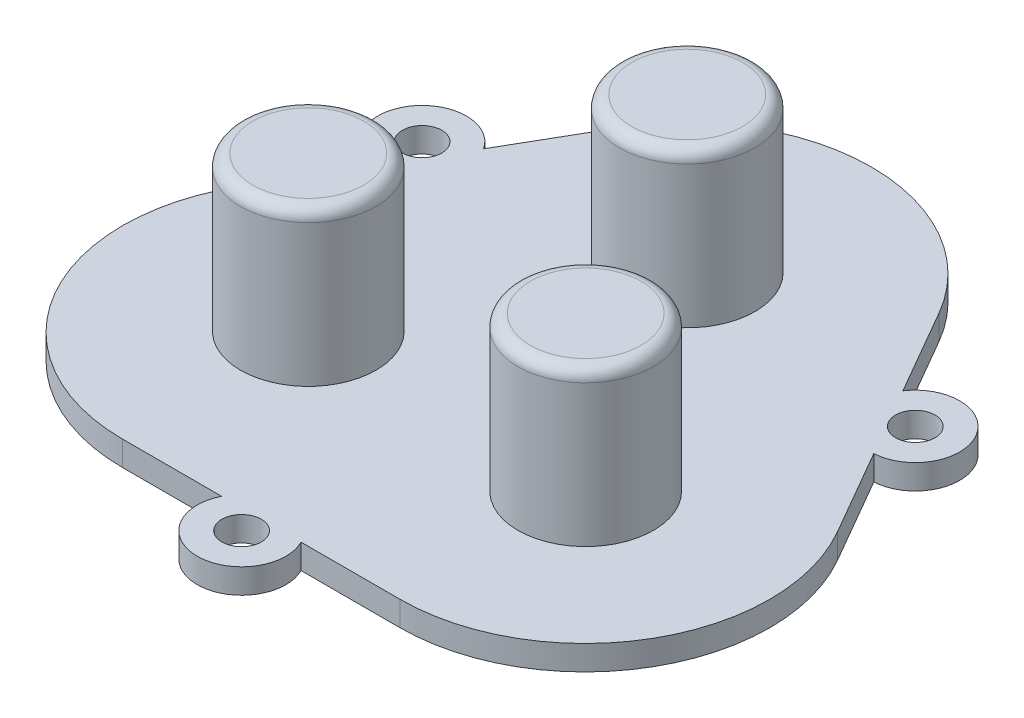
ISO-10303-21;
HEADER;
FILE_DESCRIPTION(('STEP AP214'),'2;1');
FILE_NAME('part.step','',(''),(''),'','','');
FILE_SCHEMA(('AUTOMOTIVE_DESIGN { 1 0 10303 214 1 1 1 1 }'));
ENDSEC;
DATA;
#1=APPLICATION_CONTEXT('core data for automotive mechanical design processes');
#2=APPLICATION_PROTOCOL_DEFINITION('international standard','automotive_design',2000,#1);
#3=PRODUCT_CONTEXT('',#1,'mechanical');
#4=PRODUCT('Part','Part','',(#3));
#5=PRODUCT_RELATED_PRODUCT_CATEGORY('part','',(#4));
#6=PRODUCT_DEFINITION_FORMATION('','',#4);
#7=PRODUCT_DEFINITION_CONTEXT('part definition',#1,'design');
#8=PRODUCT_DEFINITION('design','',#6,#7);
#9=PRODUCT_DEFINITION_SHAPE('','',#8);
#10=(LENGTH_UNIT() NAMED_UNIT(*) SI_UNIT(.MILLI.,.METRE.));
#11=(NAMED_UNIT(*) PLANE_ANGLE_UNIT() SI_UNIT($,.RADIAN.));
#12=(NAMED_UNIT(*) SI_UNIT($,.STERADIAN.) SOLID_ANGLE_UNIT());
#13=UNCERTAINTY_MEASURE_WITH_UNIT(LENGTH_MEASURE(1.E-05),#10,'distance_accuracy_value','');
#14=(GEOMETRIC_REPRESENTATION_CONTEXT(3) GLOBAL_UNCERTAINTY_ASSIGNED_CONTEXT((#13)) GLOBAL_UNIT_ASSIGNED_CONTEXT((#10,
#11,#12)) REPRESENTATION_CONTEXT('',''));
#15=CARTESIAN_POINT('',(0.,0.,0.));
#16=DIRECTION('',(0.,0.,1.));
#17=DIRECTION('',(1.,0.,0.));
#18=AXIS2_PLACEMENT_3D('',#15,#16,#17);
#19=CARTESIAN_POINT('',(-11.2500000511737,2.,7.14278559354404));
#20=DIRECTION('',(0.,1.,0.));
#21=DIRECTION('',(0.,0.,1.));
#22=AXIS2_PLACEMENT_3D('',#19,#20,#21);
#23=PLANE('',#22);
#24=CARTESIAN_POINT('',(-11.3100251260065,2.,7.02273544387849));
#25=DIRECTION('',(0.,1.,0.));
#26=DIRECTION('',(0.,0.,1.));
#27=AXIS2_PLACEMENT_3D('',#24,#25,#26);
#28=CIRCLE('',#27,5.5);
#29=CARTESIAN_POINT('',(-11.3100251260065,2.,12.5227354438785));
#30=VERTEX_POINT('',#29);
#31=EDGE_CURVE('E422',#30,#30,#28,.F.);
#32=ORIENTED_EDGE('',*,*,#31,.T.);
#33=EDGE_LOOP('',(#32));
#34=FACE_BOUND('',#33,.T.);
#35=CARTESIAN_POINT('',(11.1899748739934,2.,7.02273544387849));
#36=DIRECTION('',(0.,1.,0.));
#37=DIRECTION('',(0.,0.,1.));
#38=AXIS2_PLACEMENT_3D('',#35,#36,#37);
#39=CIRCLE('',#38,5.5);
#40=CARTESIAN_POINT('',(11.1899748739934,2.,12.5227354438785));
#41=VERTEX_POINT('',#40);
#42=EDGE_CURVE('E413',#41,#41,#39,.F.);
#43=ORIENTED_EDGE('',*,*,#42,.T.);
#44=EDGE_LOOP('',(#43));
#45=FACE_BOUND('',#44,.T.);
#46=CARTESIAN_POINT('',(-0.0600251260065108,2.,-12.4628361412714));
#47=DIRECTION('',(0.,1.,0.));
#48=DIRECTION('',(0.,0.,1.));
#49=AXIS2_PLACEMENT_3D('',#46,#47,#48);
#50=CIRCLE('',#49,5.5);
#51=CARTESIAN_POINT('',(-0.0600251260065108,2.,-6.96283614127141));
#52=VERTEX_POINT('',#51);
#53=EDGE_CURVE('E409',#52,#52,#50,.F.);
#54=ORIENTED_EDGE('',*,*,#53,.T.);
#55=EDGE_LOOP('',(#54));
#56=FACE_BOUND('',#55,.T.);
#57=CARTESIAN_POINT('',(-20.0010217539954,2.,-10.9000001990309));
#58=DIRECTION('',(0.,1.,0.));
#59=DIRECTION('',(0.,0.,1.));
#60=AXIS2_PLACEMENT_3D('',#57,#58,#59);
#61=CIRCLE('',#60,1.6);
#62=CARTESIAN_POINT('',(-20.0010217539954,2.,-9.30000019903093));
#63=VERTEX_POINT('',#62);
#64=EDGE_CURVE('E286',#63,#63,#61,.T.);
#65=ORIENTED_EDGE('',*,*,#64,.F.);
#66=EDGE_LOOP('',(#65));
#67=FACE_BOUND('',#66,.T.);
#68=CARTESIAN_POINT('',(-11.2500000511737,2.,7.14278559354404));
#69=DIRECTION('',(0.,1.,0.));
#70=DIRECTION('',(0.,0.,1.));
#71=AXIS2_PLACEMENT_3D('',#68,#69,#70);
#72=CIRCLE('',#71,15.);
#73=CARTESIAN_POINT('',(-24.2403811079403,2.,-0.357214406455925));
#74=VERTEX_POINT('',#73);
#75=CARTESIAN_POINT('',(-11.2500000511737,2.,22.142785593544));
#76=VERTEX_POINT('',#75);
#77=EDGE_CURVE('E186',#74,#76,#72,.T.);
#78=ORIENTED_EDGE('',*,*,#77,.T.);
#79=DIRECTION('',(1.,0.,0.));
#80=VECTOR('',#79,1.);
#81=CARTESIAN_POINT('',(-11.2500000511737,2.,22.142785593544));
#82=LINE('',#81,#80);
#83=CARTESIAN_POINT('',(-3.2249031504929,2.,22.1427855935441));
#84=VERTEX_POINT('',#83);
#85=EDGE_CURVE('E114',#76,#84,#82,.T.);
#86=ORIENTED_EDGE('',*,*,#85,.T.);
#87=CARTESIAN_POINT('',(-5.11722688081806E-08,2.,23.7427855935431));
#88=DIRECTION('',(0.,1.,0.));
#89=DIRECTION('',(0.,0.,1.));
#90=AXIS2_PLACEMENT_3D('',#87,#88,#89);
#91=CIRCLE('',#90,3.60000000000066);
#92=CARTESIAN_POINT('',(3.22490304814838,2.,22.1427855935442));
#93=VERTEX_POINT('',#92);
#94=EDGE_CURVE('E296',#84,#93,#91,.T.);
#95=ORIENTED_EDGE('',*,*,#94,.T.);
#96=DIRECTION('',(1.,0.,0.));
#97=VECTOR('',#96,1.);
#98=CARTESIAN_POINT('',(3.22490304814839,2.,22.1427855935442));
#99=LINE('',#98,#97);
#100=CARTESIAN_POINT('',(11.2499999488263,2.,22.1427855935442));
#101=VERTEX_POINT('',#100);
#102=EDGE_CURVE('E298',#93,#101,#99,.T.);
#103=ORIENTED_EDGE('',*,*,#102,.T.);
#104=CARTESIAN_POINT('',(11.2499999488264,2.,7.14278559354415));
#105=DIRECTION('',(0.,1.,0.));
#106=DIRECTION('',(0.,0.,1.));
#107=AXIS2_PLACEMENT_3D('',#104,#105,#106);
#108=CIRCLE('',#107,15.0000000000001);
#109=CARTESIAN_POINT('',(24.240381005593,2.,-0.357214406456034));
#110=VERTEX_POINT('',#109);
#111=EDGE_CURVE('E300',#101,#110,#108,.T.);
#112=ORIENTED_EDGE('',*,*,#111,.T.);
#113=DIRECTION('',(-0.500000000000005,0.,-0.866025403784436));
#114=VECTOR('',#113,1.);
#115=CARTESIAN_POINT('',(24.240381005593,2.,-0.357214406456022));
#116=LINE('',#115,#114);
#117=CARTESIAN_POINT('',(20.2278325552526,2.,-7.30715219027712));
#118=VERTEX_POINT('',#117);
#119=EDGE_CURVE('E302',#110,#118,#116,.T.);
#120=ORIENTED_EDGE('',*,*,#119,.T.);
#121=CARTESIAN_POINT('',(20.0010216516479,2.,-10.9000001990326));
#122=DIRECTION('',(0.,1.,0.));
#123=DIRECTION('',(0.,0.,1.));
#124=AXIS2_PLACEMENT_3D('',#121,#122,#123);
#125=CIRCLE('',#124,3.60000000000172);
#126=CARTESIAN_POINT('',(17.0029294559317,2.,-12.8928482077873));
#127=VERTEX_POINT('',#126);
#128=EDGE_CURVE('E304',#118,#127,#125,.T.);
#129=ORIENTED_EDGE('',*,*,#128,.T.);
#130=DIRECTION('',(-0.500000000000005,0.,-0.866025403784436));
#131=VECTOR('',#130,1.);
#132=CARTESIAN_POINT('',(17.0029294559317,2.,-12.8928482077873));
#133=LINE('',#132,#131);
#134=CARTESIAN_POINT('',(12.9903810055928,2.,-19.8427859916058));
#135=VERTEX_POINT('',#134);
#136=EDGE_CURVE('E306',#127,#135,#133,.T.);
#137=ORIENTED_EDGE('',*,*,#136,.T.);
#138=CARTESIAN_POINT('',(-5.11737398924087E-08,2.,-12.3427859916057));
#139=DIRECTION('',(0.,1.,0.));
#140=DIRECTION('',(0.,0.,1.));
#141=AXIS2_PLACEMENT_3D('',#138,#139,#140);
#142=CIRCLE('',#141,15.0000000000001);
#143=CARTESIAN_POINT('',(-12.9903811079403,2.,-19.8427859916058));
#144=VERTEX_POINT('',#143);
#145=EDGE_CURVE('E145',#135,#144,#142,.T.);
#146=ORIENTED_EDGE('',*,*,#145,.T.);
#147=DIRECTION('',(-0.499999999999998,0.,0.86602540378444));
#148=VECTOR('',#147,1.);
#149=CARTESIAN_POINT('',(-12.9903811079403,2.,-19.8427859916058));
#150=LINE('',#149,#148);
#151=CARTESIAN_POINT('',(-17.0029295582806,2.,-12.8928482077847));
#152=VERTEX_POINT('',#151);
#153=EDGE_CURVE('E139',#144,#152,#150,.T.);
#154=ORIENTED_EDGE('',*,*,#153,.T.);
#155=CARTESIAN_POINT('',(-20.0010217539954,2.,-10.9000001990309));
#156=DIRECTION('',(0.,1.,0.));
#157=DIRECTION('',(0.,0.,1.));
#158=AXIS2_PLACEMENT_3D('',#155,#156,#157);
#159=CIRCLE('',#158,3.6);
#160=CARTESIAN_POINT('',(-20.2278326576,2.,-7.30715219027715));
#161=VERTEX_POINT('',#160);
#162=EDGE_CURVE('E143',#152,#161,#159,.T.);
#163=ORIENTED_EDGE('',*,*,#162,.T.);
#164=DIRECTION('',(-0.499999999999998,0.,0.86602540378444));
#165=VECTOR('',#164,1.);
#166=CARTESIAN_POINT('',(-20.2278326576,2.,-7.30715219027714));
#167=LINE('',#166,#165);
#168=EDGE_CURVE('E58',#161,#74,#167,.T.);
#169=ORIENTED_EDGE('',*,*,#168,.T.);
#170=EDGE_LOOP('',(#78,#86,#95,#103,#112,#120,#129,#137,#146,#154,#163,#169));
#171=FACE_BOUND('',#170,.T.);
#172=CARTESIAN_POINT('',(-5.11722688081806E-08,2.,23.7427855935431));
#173=DIRECTION('',(0.,1.,0.));
#174=DIRECTION('',(0.,0.,1.));
#175=AXIS2_PLACEMENT_3D('',#172,#173,#174);
#176=CIRCLE('',#175,1.60000000000066);
#177=CARTESIAN_POINT('',(-5.11722688081806E-08,2.,25.3427855935438));
#178=VERTEX_POINT('',#177);
#179=EDGE_CURVE('E167',#178,#178,#176,.T.);
#180=ORIENTED_EDGE('',*,*,#179,.F.);
#181=EDGE_LOOP('',(#180));
#182=FACE_BOUND('',#181,.T.);
#183=CARTESIAN_POINT('',(20.0010216516479,2.,-10.9000001990326));
#184=DIRECTION('',(0.,1.,0.));
#185=DIRECTION('',(0.,0.,1.));
#186=AXIS2_PLACEMENT_3D('',#183,#184,#185);
#187=CIRCLE('',#186,1.60000000000172);
#188=CARTESIAN_POINT('',(20.0010216516479,2.,-9.30000019903091));
#189=VERTEX_POINT('',#188);
#190=EDGE_CURVE('E404',#189,#189,#187,.T.);
#191=ORIENTED_EDGE('',*,*,#190,.F.);
#192=EDGE_LOOP('',(#191));
#193=FACE_BOUND('',#192,.T.);
#194=ADVANCED_FACE('F41',(#34,#45,#56,#67,#171,#182,#193),#23,.T.);
#195=CARTESIAN_POINT('',(-11.2500000511737,0.,7.14278559354404));
#196=DIRECTION('',(0.,1.,0.));
#197=DIRECTION('',(0.,0.,1.));
#198=AXIS2_PLACEMENT_3D('',#195,#196,#197);
#199=PLANE('',#198);
#200=CARTESIAN_POINT('',(-11.2500000511737,0.,7.14278559354404));
#201=DIRECTION('',(0.,1.,0.));
#202=DIRECTION('',(0.,0.,1.));
#203=AXIS2_PLACEMENT_3D('',#200,#201,#202);
#204=CIRCLE('',#203,15.);
#205=CARTESIAN_POINT('',(-24.2403811079403,0.,-0.357214406455925));
#206=VERTEX_POINT('',#205);
#207=CARTESIAN_POINT('',(-11.2500000511737,0.,22.142785593544));
#208=VERTEX_POINT('',#207);
#209=EDGE_CURVE('E163',#206,#208,#204,.T.);
#210=ORIENTED_EDGE('',*,*,#209,.F.);
#211=DIRECTION('',(-0.499999999999998,0.,0.86602540378444));
#212=VECTOR('',#211,1.);
#213=CARTESIAN_POINT('',(-20.2278326576,0.,-7.30715219027714));
#214=LINE('',#213,#212);
#215=CARTESIAN_POINT('',(-20.2278326576,0.,-7.30715219027715));
#216=VERTEX_POINT('',#215);
#217=EDGE_CURVE('E105',#216,#206,#214,.T.);
#218=ORIENTED_EDGE('',*,*,#217,.F.);
#219=CARTESIAN_POINT('',(-20.0010217539954,0.,-10.9000001990309));
#220=DIRECTION('',(0.,1.,0.));
#221=DIRECTION('',(0.,0.,1.));
#222=AXIS2_PLACEMENT_3D('',#219,#220,#221);
#223=CIRCLE('',#222,3.6);
#224=CARTESIAN_POINT('',(-17.0029295582806,0.,-12.8928482077847));
#225=VERTEX_POINT('',#224);
#226=EDGE_CURVE('E99',#225,#216,#223,.T.);
#227=ORIENTED_EDGE('',*,*,#226,.F.);
#228=DIRECTION('',(-0.499999999999998,0.,0.86602540378444));
#229=VECTOR('',#228,1.);
#230=CARTESIAN_POINT('',(-12.9903811079403,0.,-19.8427859916058));
#231=LINE('',#230,#229);
#232=CARTESIAN_POINT('',(-12.9903811079403,0.,-19.8427859916058));
#233=VERTEX_POINT('',#232);
#234=EDGE_CURVE('E153',#233,#225,#231,.T.);
#235=ORIENTED_EDGE('',*,*,#234,.F.);
#236=CARTESIAN_POINT('',(-5.11737398924087E-08,0.,-12.3427859916057));
#237=DIRECTION('',(0.,1.,0.));
#238=DIRECTION('',(0.,0.,1.));
#239=AXIS2_PLACEMENT_3D('',#236,#237,#238);
#240=CIRCLE('',#239,15.0000000000001);
#241=CARTESIAN_POINT('',(12.9903810055928,0.,-19.8427859916058));
#242=VERTEX_POINT('',#241);
#243=EDGE_CURVE('E181',#242,#233,#240,.T.);
#244=ORIENTED_EDGE('',*,*,#243,.F.);
#245=DIRECTION('',(-0.500000000000005,0.,-0.866025403784436));
#246=VECTOR('',#245,1.);
#247=CARTESIAN_POINT('',(17.0029294559317,0.,-12.8928482077873));
#248=LINE('',#247,#246);
#249=CARTESIAN_POINT('',(17.0029294559317,0.,-12.8928482077873));
#250=VERTEX_POINT('',#249);
#251=EDGE_CURVE('E179',#250,#242,#248,.T.);
#252=ORIENTED_EDGE('',*,*,#251,.F.);
#253=CARTESIAN_POINT('',(20.0010216516479,0.,-10.9000001990326));
#254=DIRECTION('',(0.,1.,0.));
#255=DIRECTION('',(0.,0.,1.));
#256=AXIS2_PLACEMENT_3D('',#253,#254,#255);
#257=CIRCLE('',#256,3.60000000000172);
#258=CARTESIAN_POINT('',(20.2278325552526,0.,-7.30715219027712));
#259=VERTEX_POINT('',#258);
#260=EDGE_CURVE('E177',#259,#250,#257,.T.);
#261=ORIENTED_EDGE('',*,*,#260,.F.);
#262=DIRECTION('',(-0.500000000000005,0.,-0.866025403784436));
#263=VECTOR('',#262,1.);
#264=CARTESIAN_POINT('',(24.240381005593,0.,-0.357214406456022));
#265=LINE('',#264,#263);
#266=CARTESIAN_POINT('',(24.240381005593,0.,-0.357214406456034));
#267=VERTEX_POINT('',#266);
#268=EDGE_CURVE('E175',#267,#259,#265,.T.);
#269=ORIENTED_EDGE('',*,*,#268,.F.);
#270=CARTESIAN_POINT('',(11.2499999488264,0.,7.14278559354415));
#271=DIRECTION('',(0.,1.,0.));
#272=DIRECTION('',(0.,0.,1.));
#273=AXIS2_PLACEMENT_3D('',#270,#271,#272);
#274=CIRCLE('',#273,15.0000000000001);
#275=CARTESIAN_POINT('',(11.2499999488263,0.,22.1427855935442));
#276=VERTEX_POINT('',#275);
#277=EDGE_CURVE('E173',#276,#267,#274,.T.);
#278=ORIENTED_EDGE('',*,*,#277,.F.);
#279=DIRECTION('',(1.,0.,0.));
#280=VECTOR('',#279,1.);
#281=CARTESIAN_POINT('',(3.22490304814839,0.,22.1427855935442));
#282=LINE('',#281,#280);
#283=CARTESIAN_POINT('',(3.22490304814838,0.,22.1427855935442));
#284=VERTEX_POINT('',#283);
#285=EDGE_CURVE('E171',#284,#276,#282,.T.);
#286=ORIENTED_EDGE('',*,*,#285,.F.);
#287=CARTESIAN_POINT('',(-5.11722688081806E-08,0.,23.7427855935431));
#288=DIRECTION('',(0.,1.,0.));
#289=DIRECTION('',(0.,0.,1.));
#290=AXIS2_PLACEMENT_3D('',#287,#288,#289);
#291=CIRCLE('',#290,3.60000000000066);
#292=CARTESIAN_POINT('',(-3.2249031504929,0.,22.1427855935441));
#293=VERTEX_POINT('',#292);
#294=EDGE_CURVE('E169',#293,#284,#291,.T.);
#295=ORIENTED_EDGE('',*,*,#294,.F.);
#296=DIRECTION('',(1.,0.,0.));
#297=VECTOR('',#296,1.);
#298=CARTESIAN_POINT('',(-11.2500000511737,0.,22.142785593544));
#299=LINE('',#298,#297);
#300=EDGE_CURVE('E166',#208,#293,#299,.T.);
#301=ORIENTED_EDGE('',*,*,#300,.F.);
#302=EDGE_LOOP('',(#210,#218,#227,#235,#244,#252,#261,#269,#278,#286,#295,#301));
#303=FACE_BOUND('',#302,.T.);
#304=CARTESIAN_POINT('',(-5.11722688081806E-08,0.,23.7427855935431));
#305=DIRECTION('',(0.,1.,0.));
#306=DIRECTION('',(0.,0.,1.));
#307=AXIS2_PLACEMENT_3D('',#304,#305,#306);
#308=CIRCLE('',#307,1.60000000000066);
#309=CARTESIAN_POINT('',(-5.11722688081806E-08,0.,25.3427855935438));
#310=VERTEX_POINT('',#309);
#311=EDGE_CURVE('E284',#310,#310,#308,.T.);
#312=ORIENTED_EDGE('',*,*,#311,.T.);
#313=EDGE_LOOP('',(#312));
#314=FACE_BOUND('',#313,.T.);
#315=CARTESIAN_POINT('',(-20.0010217539954,0.,-10.9000001990309));
#316=DIRECTION('',(0.,1.,0.));
#317=DIRECTION('',(0.,0.,1.));
#318=AXIS2_PLACEMENT_3D('',#315,#316,#317);
#319=CIRCLE('',#318,1.6);
#320=CARTESIAN_POINT('',(-20.0010217539954,0.,-9.30000019903093));
#321=VERTEX_POINT('',#320);
#322=EDGE_CURVE('E290',#321,#321,#319,.T.);
#323=ORIENTED_EDGE('',*,*,#322,.T.);
#324=EDGE_LOOP('',(#323));
#325=FACE_BOUND('',#324,.T.);
#326=CARTESIAN_POINT('',(20.0010216516479,0.,-10.9000001990326));
#327=DIRECTION('',(0.,1.,0.));
#328=DIRECTION('',(0.,0.,1.));
#329=AXIS2_PLACEMENT_3D('',#326,#327,#328);
#330=CIRCLE('',#329,1.60000000000172);
#331=CARTESIAN_POINT('',(20.0010216516479,0.,-9.30000019903091));
#332=VERTEX_POINT('',#331);
#333=EDGE_CURVE('E407',#332,#332,#330,.T.);
#334=ORIENTED_EDGE('',*,*,#333,.T.);
#335=EDGE_LOOP('',(#334));
#336=FACE_BOUND('',#335,.T.);
#337=ADVANCED_FACE('F252',(#303,#314,#325,#336),#199,.F.);
#338=CARTESIAN_POINT('',(-11.2500000511737,2.,7.14278559354404));
#339=DIRECTION('',(0.,-1.,0.));
#340=DIRECTION('',(0.,0.,-1.));
#341=AXIS2_PLACEMENT_3D('',#338,#339,#340);
#342=CYLINDRICAL_SURFACE('',#341,15.);
#343=ORIENTED_EDGE('',*,*,#209,.T.);
#344=DIRECTION('',(0.,-1.,0.));
#345=VECTOR('',#344,1.);
#346=CARTESIAN_POINT('',(-11.2500000511737,2.,22.142785593544));
#347=LINE('',#346,#345);
#348=EDGE_CURVE('E211',#76,#208,#347,.T.);
#349=ORIENTED_EDGE('',*,*,#348,.F.);
#350=ORIENTED_EDGE('',*,*,#77,.F.);
#351=DIRECTION('',(0.,-1.,0.));
#352=VECTOR('',#351,1.);
#353=CARTESIAN_POINT('',(-24.2403811079403,2.,-0.357214406455925));
#354=LINE('',#353,#352);
#355=EDGE_CURVE('E159',#74,#206,#354,.T.);
#356=ORIENTED_EDGE('',*,*,#355,.T.);
#357=EDGE_LOOP('',(#343,#349,#350,#356));
#358=FACE_BOUND('',#357,.T.);
#359=ADVANCED_FACE('F259',(#358),#342,.T.);
#360=CARTESIAN_POINT('',(-11.2500000511737,2.,22.142785593544));
#361=DIRECTION('',(0.,0.,-1.));
#362=DIRECTION('',(-1.,0.,0.));
#363=AXIS2_PLACEMENT_3D('',#360,#361,#362);
#364=PLANE('',#363);
#365=ORIENTED_EDGE('',*,*,#300,.T.);
#366=DIRECTION('',(0.,-1.,0.));
#367=VECTOR('',#366,1.);
#368=CARTESIAN_POINT('',(-3.2249031504929,2.,22.1427855935441));
#369=LINE('',#368,#367);
#370=EDGE_CURVE('E208',#84,#293,#369,.T.);
#371=ORIENTED_EDGE('',*,*,#370,.F.);
#372=ORIENTED_EDGE('',*,*,#85,.F.);
#373=ORIENTED_EDGE('',*,*,#348,.T.);
#374=EDGE_LOOP('',(#365,#371,#372,#373));
#375=FACE_BOUND('',#374,.T.);
#376=ADVANCED_FACE('F321',(#375),#364,.F.);
#377=CARTESIAN_POINT('',(-5.11722688081806E-08,2.,23.7427855935431));
#378=DIRECTION('',(0.,-1.,0.));
#379=DIRECTION('',(0.,0.,-1.));
#380=AXIS2_PLACEMENT_3D('',#377,#378,#379);
#381=CYLINDRICAL_SURFACE('',#380,3.60000000000066);
#382=ORIENTED_EDGE('',*,*,#294,.T.);
#383=DIRECTION('',(0.,-1.,0.));
#384=VECTOR('',#383,1.);
#385=CARTESIAN_POINT('',(3.22490304814838,2.,22.1427855935442));
#386=LINE('',#385,#384);
#387=EDGE_CURVE('E205',#93,#284,#386,.T.);
#388=ORIENTED_EDGE('',*,*,#387,.F.);
#389=ORIENTED_EDGE('',*,*,#94,.F.);
#390=ORIENTED_EDGE('',*,*,#370,.T.);
#391=EDGE_LOOP('',(#382,#388,#389,#390));
#392=FACE_BOUND('',#391,.T.);
#393=ADVANCED_FACE('F323',(#392),#381,.T.);
#394=CARTESIAN_POINT('',(3.22490304814839,2.,22.1427855935442));
#395=DIRECTION('',(0.,0.,-1.));
#396=DIRECTION('',(-1.,0.,0.));
#397=AXIS2_PLACEMENT_3D('',#394,#395,#396);
#398=PLANE('',#397);
#399=ORIENTED_EDGE('',*,*,#285,.T.);
#400=DIRECTION('',(0.,-1.,0.));
#401=VECTOR('',#400,1.);
#402=CARTESIAN_POINT('',(11.2499999488263,2.,22.1427855935442));
#403=LINE('',#402,#401);
#404=EDGE_CURVE('E202',#101,#276,#403,.T.);
#405=ORIENTED_EDGE('',*,*,#404,.F.);
#406=ORIENTED_EDGE('',*,*,#102,.F.);
#407=ORIENTED_EDGE('',*,*,#387,.T.);
#408=EDGE_LOOP('',(#399,#405,#406,#407));
#409=FACE_BOUND('',#408,.T.);
#410=ADVANCED_FACE('F328',(#409),#398,.F.);
#411=CARTESIAN_POINT('',(11.2499999488264,2.,7.14278559354415));
#412=DIRECTION('',(0.,-1.,0.));
#413=DIRECTION('',(0.,0.,-1.));
#414=AXIS2_PLACEMENT_3D('',#411,#412,#413);
#415=CYLINDRICAL_SURFACE('',#414,15.0000000000001);
#416=ORIENTED_EDGE('',*,*,#277,.T.);
#417=DIRECTION('',(0.,-1.,0.));
#418=VECTOR('',#417,1.);
#419=CARTESIAN_POINT('',(24.240381005593,2.,-0.357214406456034));
#420=LINE('',#419,#418);
#421=EDGE_CURVE('E199',#110,#267,#420,.T.);
#422=ORIENTED_EDGE('',*,*,#421,.F.);
#423=ORIENTED_EDGE('',*,*,#111,.F.);
#424=ORIENTED_EDGE('',*,*,#404,.T.);
#425=EDGE_LOOP('',(#416,#422,#423,#424));
#426=FACE_BOUND('',#425,.T.);
#427=ADVANCED_FACE('F334',(#426),#415,.T.);
#428=CARTESIAN_POINT('',(24.240381005593,2.,-0.357214406456022));
#429=DIRECTION('',(-0.866025403784436,0.,0.500000000000005));
#430=DIRECTION('',(0.500000000000005,0.,0.866025403784436));
#431=AXIS2_PLACEMENT_3D('',#428,#429,#430);
#432=PLANE('',#431);
#433=ORIENTED_EDGE('',*,*,#268,.T.);
#434=DIRECTION('',(0.,-1.,0.));
#435=VECTOR('',#434,1.);
#436=CARTESIAN_POINT('',(20.2278325552526,2.,-7.30715219027712));
#437=LINE('',#436,#435);
#438=EDGE_CURVE('E196',#118,#259,#437,.T.);
#439=ORIENTED_EDGE('',*,*,#438,.F.);
#440=ORIENTED_EDGE('',*,*,#119,.F.);
#441=ORIENTED_EDGE('',*,*,#421,.T.);
#442=EDGE_LOOP('',(#433,#439,#440,#441));
#443=FACE_BOUND('',#442,.T.);
#444=ADVANCED_FACE('F338',(#443),#432,.F.);
#445=CARTESIAN_POINT('',(20.0010216516479,2.,-10.9000001990326));
#446=DIRECTION('',(0.,-1.,0.));
#447=DIRECTION('',(0.,0.,-1.));
#448=AXIS2_PLACEMENT_3D('',#445,#446,#447);
#449=CYLINDRICAL_SURFACE('',#448,3.60000000000172);
#450=ORIENTED_EDGE('',*,*,#260,.T.);
#451=DIRECTION('',(0.,-1.,0.));
#452=VECTOR('',#451,1.);
#453=CARTESIAN_POINT('',(17.0029294559317,2.,-12.8928482077873));
#454=LINE('',#453,#452);
#455=EDGE_CURVE('E193',#127,#250,#454,.T.);
#456=ORIENTED_EDGE('',*,*,#455,.F.);
#457=ORIENTED_EDGE('',*,*,#128,.F.);
#458=ORIENTED_EDGE('',*,*,#438,.T.);
#459=EDGE_LOOP('',(#450,#456,#457,#458));
#460=FACE_BOUND('',#459,.T.);
#461=ADVANCED_FACE('F341',(#460),#449,.T.);
#462=CARTESIAN_POINT('',(17.0029294559317,2.,-12.8928482077873));
#463=DIRECTION('',(-0.866025403784436,0.,0.500000000000005));
#464=DIRECTION('',(0.500000000000005,0.,0.866025403784436));
#465=AXIS2_PLACEMENT_3D('',#462,#463,#464);
#466=PLANE('',#465);
#467=ORIENTED_EDGE('',*,*,#251,.T.);
#468=DIRECTION('',(0.,-1.,0.));
#469=VECTOR('',#468,1.);
#470=CARTESIAN_POINT('',(12.9903810055928,2.,-19.8427859916058));
#471=LINE('',#470,#469);
#472=EDGE_CURVE('E190',#135,#242,#471,.T.);
#473=ORIENTED_EDGE('',*,*,#472,.F.);
#474=ORIENTED_EDGE('',*,*,#136,.F.);
#475=ORIENTED_EDGE('',*,*,#455,.T.);
#476=EDGE_LOOP('',(#467,#473,#474,#475));
#477=FACE_BOUND('',#476,.T.);
#478=ADVANCED_FACE('F247',(#477),#466,.F.);
#479=CARTESIAN_POINT('',(-5.11737398924087E-08,2.,-12.3427859916057));
#480=DIRECTION('',(0.,-1.,0.));
#481=DIRECTION('',(0.,0.,-1.));
#482=AXIS2_PLACEMENT_3D('',#479,#480,#481);
#483=CYLINDRICAL_SURFACE('',#482,15.0000000000001);
#484=ORIENTED_EDGE('',*,*,#243,.T.);
#485=DIRECTION('',(0.,-1.,0.));
#486=VECTOR('',#485,1.);
#487=CARTESIAN_POINT('',(-12.9903811079403,2.,-19.8427859916058));
#488=LINE('',#487,#486);
#489=EDGE_CURVE('E154',#144,#233,#488,.T.);
#490=ORIENTED_EDGE('',*,*,#489,.F.);
#491=ORIENTED_EDGE('',*,*,#145,.F.);
#492=ORIENTED_EDGE('',*,*,#472,.T.);
#493=EDGE_LOOP('',(#484,#490,#491,#492));
#494=FACE_BOUND('',#493,.T.);
#495=ADVANCED_FACE('F236',(#494),#483,.T.);
#496=CARTESIAN_POINT('',(-12.9903811079403,2.,-19.8427859916058));
#497=DIRECTION('',(0.86602540378444,0.,0.499999999999998));
#498=DIRECTION('',(0.499999999999998,0.,-0.86602540378444));
#499=AXIS2_PLACEMENT_3D('',#496,#497,#498);
#500=PLANE('',#499);
#501=CARTESIAN_POINT('',(-14.5344864315786,1.,-17.1683171188267));
#502=DIRECTION('',(0.86602540378444,0.,0.499999999999998));
#503=DIRECTION('',(0.499999999999998,0.,-0.86602540378444));
#504=AXIS2_PLACEMENT_3D('',#501,#502,#503);
#505=CIRCLE('',#504,0.499999999999999);
#506=CARTESIAN_POINT('',(-14.2844864315786,1.,-17.6013298207189));
#507=VERTEX_POINT('',#506);
#508=EDGE_CURVE('E11',#507,#507,#505,.F.);
#509=ORIENTED_EDGE('',*,*,#508,.F.);
#510=EDGE_LOOP('',(#509));
#511=FACE_BOUND('',#510,.T.);
#512=CARTESIAN_POINT('',(-13.5344864315786,1.,-18.9003679263956));
#513=DIRECTION('',(0.86602540378444,0.,0.499999999999998));
#514=DIRECTION('',(0.499999999999998,0.,-0.86602540378444));
#515=AXIS2_PLACEMENT_3D('',#512,#513,#514);
#516=CIRCLE('',#515,0.500000000000002);
#517=CARTESIAN_POINT('',(-13.2844864315786,1.,-19.3333806282878));
#518=VERTEX_POINT('',#517);
#519=EDGE_CURVE('E50',#518,#518,#516,.F.);
#520=ORIENTED_EDGE('',*,*,#519,.F.);
#521=EDGE_LOOP('',(#520));
#522=FACE_BOUND('',#521,.T.);
#523=ORIENTED_EDGE('',*,*,#234,.T.);
#524=DIRECTION('',(0.,-1.,0.));
#525=VECTOR('',#524,1.);
#526=CARTESIAN_POINT('',(-17.0029295582806,2.,-12.8928482077847));
#527=LINE('',#526,#525);
#528=EDGE_CURVE('E150',#152,#225,#527,.T.);
#529=ORIENTED_EDGE('',*,*,#528,.F.);
#530=ORIENTED_EDGE('',*,*,#153,.F.);
#531=ORIENTED_EDGE('',*,*,#489,.T.);
#532=EDGE_LOOP('',(#523,#529,#530,#531));
#533=FACE_BOUND('',#532,.T.);
#534=ADVANCED_FACE('F151',(#511,#522,#533),#500,.F.);
#535=CARTESIAN_POINT('',(-20.0010217539954,2.,-10.9000001990309));
#536=DIRECTION('',(0.,-1.,0.));
#537=DIRECTION('',(0.,0.,-1.));
#538=AXIS2_PLACEMENT_3D('',#535,#536,#537);
#539=CYLINDRICAL_SURFACE('',#538,3.6);
#540=ORIENTED_EDGE('',*,*,#226,.T.);
#541=DIRECTION('',(0.,-1.,0.));
#542=VECTOR('',#541,1.);
#543=CARTESIAN_POINT('',(-20.2278326576,2.,-7.30715219027715));
#544=LINE('',#543,#542);
#545=EDGE_CURVE('E155',#161,#216,#544,.T.);
#546=ORIENTED_EDGE('',*,*,#545,.F.);
#547=ORIENTED_EDGE('',*,*,#162,.F.);
#548=ORIENTED_EDGE('',*,*,#528,.T.);
#549=EDGE_LOOP('',(#540,#546,#547,#548));
#550=FACE_BOUND('',#549,.T.);
#551=ADVANCED_FACE('F157',(#550),#539,.T.);
#552=CARTESIAN_POINT('',(-20.2278326576,2.,-7.30715219027714));
#553=DIRECTION('',(0.86602540378444,0.,0.499999999999998));
#554=DIRECTION('',(0.499999999999998,0.,-0.86602540378444));
#555=AXIS2_PLACEMENT_3D('',#552,#553,#554);
#556=PLANE('',#555);
#557=ORIENTED_EDGE('',*,*,#217,.T.);
#558=ORIENTED_EDGE('',*,*,#355,.F.);
#559=ORIENTED_EDGE('',*,*,#168,.F.);
#560=ORIENTED_EDGE('',*,*,#545,.T.);
#561=EDGE_LOOP('',(#557,#558,#559,#560));
#562=FACE_BOUND('',#561,.T.);
#563=ADVANCED_FACE('F244',(#562),#556,.F.);
#564=CARTESIAN_POINT('',(-5.11722688081806E-08,2.,23.7427855935431));
#565=DIRECTION('',(0.,-1.,0.));
#566=DIRECTION('',(0.,0.,-1.));
#567=AXIS2_PLACEMENT_3D('',#564,#565,#566);
#568=CYLINDRICAL_SURFACE('',#567,1.60000000000066);
#569=ORIENTED_EDGE('',*,*,#179,.T.);
#570=EDGE_LOOP('',(#569));
#571=FACE_BOUND('',#570,.T.);
#572=ORIENTED_EDGE('',*,*,#311,.F.);
#573=EDGE_LOOP('',(#572));
#574=FACE_BOUND('',#573,.T.);
#575=ADVANCED_FACE('F265',(#571,#574),#568,.F.);
#576=CARTESIAN_POINT('',(-20.0010217539954,2.,-10.9000001990309));
#577=DIRECTION('',(0.,-1.,0.));
#578=DIRECTION('',(0.,0.,-1.));
#579=AXIS2_PLACEMENT_3D('',#576,#577,#578);
#580=CYLINDRICAL_SURFACE('',#579,1.6);
#581=ORIENTED_EDGE('',*,*,#64,.T.);
#582=EDGE_LOOP('',(#581));
#583=FACE_BOUND('',#582,.T.);
#584=ORIENTED_EDGE('',*,*,#322,.F.);
#585=EDGE_LOOP('',(#584));
#586=FACE_BOUND('',#585,.T.);
#587=ADVANCED_FACE('F272',(#583,#586),#580,.F.);
#588=CARTESIAN_POINT('',(20.0010216516479,2.,-10.9000001990326));
#589=DIRECTION('',(0.,-1.,0.));
#590=DIRECTION('',(0.,0.,-1.));
#591=AXIS2_PLACEMENT_3D('',#588,#589,#590);
#592=CYLINDRICAL_SURFACE('',#591,1.60000000000172);
#593=ORIENTED_EDGE('',*,*,#190,.T.);
#594=EDGE_LOOP('',(#593));
#595=FACE_BOUND('',#594,.T.);
#596=ORIENTED_EDGE('',*,*,#333,.F.);
#597=EDGE_LOOP('',(#596));
#598=FACE_BOUND('',#597,.T.);
#599=ADVANCED_FACE('F277',(#595,#598),#592,.F.);
#600=CARTESIAN_POINT('',(-0.0600251260065108,14.5,-12.4628361412714));
#601=DIRECTION('',(0.,-1.,0.));
#602=DIRECTION('',(0.,0.,-1.));
#603=AXIS2_PLACEMENT_3D('',#600,#601,#602);
#604=CYLINDRICAL_SURFACE('',#603,5.5);
#605=CARTESIAN_POINT('',(-0.0600251260065108,13.5,-12.4628361412714));
#606=DIRECTION('',(0.,1.,0.));
#607=DIRECTION('',(0.,0.,1.));
#608=AXIS2_PLACEMENT_3D('',#605,#606,#607);
#609=CIRCLE('',#608,5.5);
#610=CARTESIAN_POINT('',(-0.0600251260065108,13.5,-6.96283614127141));
#611=VERTEX_POINT('',#610);
#612=EDGE_CURVE('E228',#611,#611,#609,.F.);
#613=ORIENTED_EDGE('',*,*,#612,.T.);
#614=EDGE_LOOP('',(#613));
#615=FACE_BOUND('',#614,.T.);
#616=ORIENTED_EDGE('',*,*,#53,.F.);
#617=EDGE_LOOP('',(#616));
#618=FACE_BOUND('',#617,.T.);
#619=ADVANCED_FACE('F393',(#615,#618),#604,.T.);
#620=CARTESIAN_POINT('',(-0.0600251260065108,14.5,-12.4628361412714));
#621=DIRECTION('',(0.,1.,0.));
#622=DIRECTION('',(0.,0.,1.));
#623=AXIS2_PLACEMENT_3D('',#620,#621,#622);
#624=PLANE('',#623);
#625=CARTESIAN_POINT('',(-0.0600251260065108,14.5,-12.4628361412714));
#626=DIRECTION('',(0.,1.,0.));
#627=DIRECTION('',(0.,0.,1.));
#628=AXIS2_PLACEMENT_3D('',#625,#626,#627);
#629=CIRCLE('',#628,4.5);
#630=CARTESIAN_POINT('',(-0.0600251260065108,14.5,-7.96283614127141));
#631=VERTEX_POINT('',#630);
#632=EDGE_CURVE('E225',#631,#631,#629,.T.);
#633=ORIENTED_EDGE('',*,*,#632,.T.);
#634=EDGE_LOOP('',(#633));
#635=FACE_BOUND('',#634,.T.);
#636=ADVANCED_FACE('F386',(#635),#624,.T.);
#637=CARTESIAN_POINT('',(11.1899748739934,14.5,7.02273544387849));
#638=DIRECTION('',(0.,-1.,0.));
#639=DIRECTION('',(0.,0.,-1.));
#640=AXIS2_PLACEMENT_3D('',#637,#638,#639);
#641=CYLINDRICAL_SURFACE('',#640,5.5);
#642=CARTESIAN_POINT('',(11.1899748739934,13.5,7.02273544387849));
#643=DIRECTION('',(0.,1.,0.));
#644=DIRECTION('',(0.,0.,1.));
#645=AXIS2_PLACEMENT_3D('',#642,#643,#644);
#646=CIRCLE('',#645,5.5);
#647=CARTESIAN_POINT('',(11.1899748739934,13.5,12.5227354438785));
#648=VERTEX_POINT('',#647);
#649=EDGE_CURVE('E222',#648,#648,#646,.F.);
#650=ORIENTED_EDGE('',*,*,#649,.T.);
#651=EDGE_LOOP('',(#650));
#652=FACE_BOUND('',#651,.T.);
#653=ORIENTED_EDGE('',*,*,#42,.F.);
#654=EDGE_LOOP('',(#653));
#655=FACE_BOUND('',#654,.T.);
#656=ADVANCED_FACE('F378',(#652,#655),#641,.T.);
#657=CARTESIAN_POINT('',(11.1899748739934,14.5,7.02273544387849));
#658=DIRECTION('',(0.,1.,0.));
#659=DIRECTION('',(0.,0.,1.));
#660=AXIS2_PLACEMENT_3D('',#657,#658,#659);
#661=PLANE('',#660);
#662=CARTESIAN_POINT('',(11.1899748739934,14.5,7.02273544387849));
#663=DIRECTION('',(0.,1.,0.));
#664=DIRECTION('',(0.,0.,1.));
#665=AXIS2_PLACEMENT_3D('',#662,#663,#664);
#666=CIRCLE('',#665,4.5);
#667=CARTESIAN_POINT('',(11.1899748739934,14.5,11.5227354438785));
#668=VERTEX_POINT('',#667);
#669=EDGE_CURVE('E219',#668,#668,#666,.T.);
#670=ORIENTED_EDGE('',*,*,#669,.T.);
#671=EDGE_LOOP('',(#670));
#672=FACE_BOUND('',#671,.T.);
#673=ADVANCED_FACE('F375',(#672),#661,.T.);
#674=CARTESIAN_POINT('',(-11.3100251260065,14.5,7.02273544387849));
#675=DIRECTION('',(0.,-1.,0.));
#676=DIRECTION('',(0.,0.,-1.));
#677=AXIS2_PLACEMENT_3D('',#674,#675,#676);
#678=CYLINDRICAL_SURFACE('',#677,5.5);
#679=CARTESIAN_POINT('',(-11.3100251260065,13.5,7.02273544387849));
#680=DIRECTION('',(0.,1.,0.));
#681=DIRECTION('',(0.,0.,1.));
#682=AXIS2_PLACEMENT_3D('',#679,#680,#681);
#683=CIRCLE('',#682,5.5);
#684=CARTESIAN_POINT('',(-11.3100251260065,13.5,12.5227354438785));
#685=VERTEX_POINT('',#684);
#686=EDGE_CURVE('E216',#685,#685,#683,.F.);
#687=ORIENTED_EDGE('',*,*,#686,.T.);
#688=EDGE_LOOP('',(#687));
#689=FACE_BOUND('',#688,.T.);
#690=ORIENTED_EDGE('',*,*,#31,.F.);
#691=EDGE_LOOP('',(#690));
#692=FACE_BOUND('',#691,.T.);
#693=ADVANCED_FACE('F377',(#689,#692),#678,.T.);
#694=CARTESIAN_POINT('',(-11.3100251260065,14.5,7.02273544387849));
#695=DIRECTION('',(0.,1.,0.));
#696=DIRECTION('',(0.,0.,1.));
#697=AXIS2_PLACEMENT_3D('',#694,#695,#696);
#698=PLANE('',#697);
#699=CARTESIAN_POINT('',(-11.3100251260065,14.5,7.02273544387849));
#700=DIRECTION('',(0.,1.,0.));
#701=DIRECTION('',(0.,0.,1.));
#702=AXIS2_PLACEMENT_3D('',#699,#700,#701);
#703=CIRCLE('',#702,4.5);
#704=CARTESIAN_POINT('',(-11.3100251260065,14.5,11.5227354438785));
#705=VERTEX_POINT('',#704);
#706=EDGE_CURVE('E213',#705,#705,#703,.T.);
#707=ORIENTED_EDGE('',*,*,#706,.T.);
#708=EDGE_LOOP('',(#707));
#709=FACE_BOUND('',#708,.T.);
#710=ADVANCED_FACE('F364',(#709),#698,.T.);
#711=CARTESIAN_POINT('',(-11.3100251260065,13.5,7.02273544387849));
#712=DIRECTION('',(0.,1.,0.));
#713=DIRECTION('',(0.,0.,1.));
#714=AXIS2_PLACEMENT_3D('',#711,#712,#713);
#715=TOROIDAL_SURFACE('',#714,4.5,1.);
#716=ORIENTED_EDGE('',*,*,#686,.F.);
#717=EDGE_LOOP('',(#716));
#718=FACE_BOUND('',#717,.T.);
#719=ORIENTED_EDGE('',*,*,#706,.F.);
#720=EDGE_LOOP('',(#719));
#721=FACE_BOUND('',#720,.T.);
#722=ADVANCED_FACE('F361',(#718,#721),#715,.T.);
#723=CARTESIAN_POINT('',(11.1899748739934,13.5,7.02273544387849));
#724=DIRECTION('',(0.,1.,0.));
#725=DIRECTION('',(0.,0.,1.));
#726=AXIS2_PLACEMENT_3D('',#723,#724,#725);
#727=TOROIDAL_SURFACE('',#726,4.5,1.);
#728=ORIENTED_EDGE('',*,*,#649,.F.);
#729=EDGE_LOOP('',(#728));
#730=FACE_BOUND('',#729,.T.);
#731=ORIENTED_EDGE('',*,*,#669,.F.);
#732=EDGE_LOOP('',(#731));
#733=FACE_BOUND('',#732,.T.);
#734=ADVANCED_FACE('F363',(#730,#733),#727,.T.);
#735=CARTESIAN_POINT('',(-0.0600251260065108,13.5,-12.4628361412714));
#736=DIRECTION('',(0.,1.,0.));
#737=DIRECTION('',(0.,0.,1.));
#738=AXIS2_PLACEMENT_3D('',#735,#736,#737);
#739=TOROIDAL_SURFACE('',#738,4.5,1.);
#740=ORIENTED_EDGE('',*,*,#612,.F.);
#741=EDGE_LOOP('',(#740));
#742=FACE_BOUND('',#741,.T.);
#743=ORIENTED_EDGE('',*,*,#632,.F.);
#744=EDGE_LOOP('',(#743));
#745=FACE_BOUND('',#744,.T.);
#746=ADVANCED_FACE('F43',(#742,#745),#739,.T.);
#747=CARTESIAN_POINT('',(-14.0541016738493,1.,-19.2003679263956));
#748=DIRECTION('',(0.86602540378444,0.,0.499999999999998));
#749=DIRECTION('',(0.499999999999998,0.,-0.86602540378444));
#750=AXIS2_PLACEMENT_3D('',#747,#748,#749);
#751=CYLINDRICAL_SURFACE('',#750,0.500000000000002);
#752=CARTESIAN_POINT('',(-14.0541016738493,1.,-19.2003679263956));
#753=DIRECTION('',(-0.86602540378444,0.,-0.499999999999998));
#754=DIRECTION('',(-0.499999999999998,0.,0.86602540378444));
#755=AXIS2_PLACEMENT_3D('',#752,#753,#754);
#756=CIRCLE('',#755,0.500000000000002);
#757=CARTESIAN_POINT('',(-14.3041016738493,1.,-18.7673552245034));
#758=VERTEX_POINT('',#757);
#759=EDGE_CURVE('E424',#758,#758,#756,.T.);
#760=ORIENTED_EDGE('',*,*,#759,.F.);
#761=EDGE_LOOP('',(#760));
#762=FACE_BOUND('',#761,.T.);
#763=ORIENTED_EDGE('',*,*,#519,.T.);
#764=EDGE_LOOP('',(#763));
#765=FACE_BOUND('',#764,.T.);
#766=ADVANCED_FACE('F233',(#762,#765),#751,.T.);
#767=CARTESIAN_POINT('',(-14.0541016738493,1.,-19.2003679263956));
#768=DIRECTION('',(-0.86602540378444,0.,-0.499999999999998));
#769=DIRECTION('',(-0.499999999999998,0.,0.86602540378444));
#770=AXIS2_PLACEMENT_3D('',#767,#768,#769);
#771=PLANE('',#770);
#772=ORIENTED_EDGE('',*,*,#759,.T.);
#773=EDGE_LOOP('',(#772));
#774=FACE_BOUND('',#773,.T.);
#775=ADVANCED_FACE('F436',(#774),#771,.T.);
#776=CARTESIAN_POINT('',(-15.0541016738493,1.,-17.4683171188267));
#777=DIRECTION('',(0.86602540378444,0.,0.499999999999998));
#778=DIRECTION('',(0.499999999999998,0.,-0.86602540378444));
#779=AXIS2_PLACEMENT_3D('',#776,#777,#778);
#780=CYLINDRICAL_SURFACE('',#779,0.499999999999999);
#781=CARTESIAN_POINT('',(-15.0541016738493,1.,-17.4683171188267));
#782=DIRECTION('',(-0.86602540378444,0.,-0.499999999999998));
#783=DIRECTION('',(-0.499999999999998,0.,0.86602540378444));
#784=AXIS2_PLACEMENT_3D('',#781,#782,#783);
#785=CIRCLE('',#784,0.499999999999999);
#786=CARTESIAN_POINT('',(-15.3041016738493,1.,-17.0353044169345));
#787=VERTEX_POINT('',#786);
#788=EDGE_CURVE('E427',#787,#787,#785,.T.);
#789=ORIENTED_EDGE('',*,*,#788,.F.);
#790=EDGE_LOOP('',(#789));
#791=FACE_BOUND('',#790,.T.);
#792=ORIENTED_EDGE('',*,*,#508,.T.);
#793=EDGE_LOOP('',(#792));
#794=FACE_BOUND('',#793,.T.);
#795=ADVANCED_FACE('F433',(#791,#794),#780,.T.);
#796=CARTESIAN_POINT('',(-15.0541016738493,1.,-17.4683171188267));
#797=DIRECTION('',(-0.86602540378444,0.,-0.499999999999998));
#798=DIRECTION('',(-0.499999999999998,0.,0.86602540378444));
#799=AXIS2_PLACEMENT_3D('',#796,#797,#798);
#800=PLANE('',#799);
#801=ORIENTED_EDGE('',*,*,#788,.T.);
#802=EDGE_LOOP('',(#801));
#803=FACE_BOUND('',#802,.T.);
#804=ADVANCED_FACE('F431',(#803),#800,.T.);
#805=CLOSED_SHELL('',(#194,#337,#359,#376,#393,#410,#427,#444,#461,#478,#495,#534,#551,#563,
#575,#587,#599,#619,#636,#656,#673,#693,#710,#722,#734,#746,#766,#775,#795,#804));
#806=MANIFOLD_SOLID_BREP('B2',#805);
#807=ADVANCED_BREP_SHAPE_REPRESENTATION('',(#18,#806),#14);
#808=SHAPE_DEFINITION_REPRESENTATION(#9,#807);
ENDSEC;
END-ISO-10303-21;
